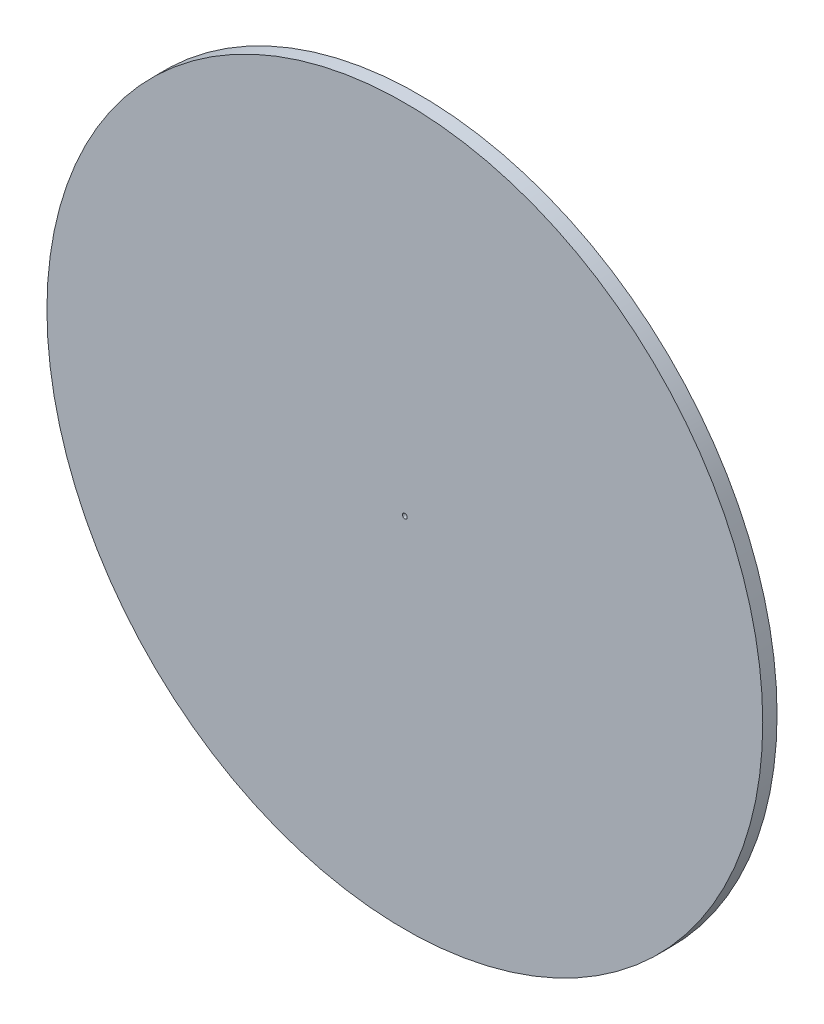
ISO-10303-21;
HEADER;
FILE_DESCRIPTION(('STEP AP214'),'2;1');
FILE_NAME('part.step','',(''),(''),'','','');
FILE_SCHEMA(('AUTOMOTIVE_DESIGN { 1 0 10303 214 1 1 1 1 }'));
ENDSEC;
DATA;
#1=APPLICATION_CONTEXT('core data for automotive mechanical design processes');
#2=APPLICATION_PROTOCOL_DEFINITION('international standard','automotive_design',2000,#1);
#3=PRODUCT_CONTEXT('',#1,'mechanical');
#4=PRODUCT('Part','Part','',(#3));
#5=PRODUCT_RELATED_PRODUCT_CATEGORY('part','',(#4));
#6=PRODUCT_DEFINITION_FORMATION('','',#4);
#7=PRODUCT_DEFINITION_CONTEXT('part definition',#1,'design');
#8=PRODUCT_DEFINITION('design','',#6,#7);
#9=PRODUCT_DEFINITION_SHAPE('','',#8);
#10=(LENGTH_UNIT() NAMED_UNIT(*) SI_UNIT(.MILLI.,.METRE.));
#11=(NAMED_UNIT(*) PLANE_ANGLE_UNIT() SI_UNIT($,.RADIAN.));
#12=(NAMED_UNIT(*) SI_UNIT($,.STERADIAN.) SOLID_ANGLE_UNIT());
#13=UNCERTAINTY_MEASURE_WITH_UNIT(LENGTH_MEASURE(1.E-05),#10,'distance_accuracy_value','');
#14=(GEOMETRIC_REPRESENTATION_CONTEXT(3) GLOBAL_UNCERTAINTY_ASSIGNED_CONTEXT((#13)) GLOBAL_UNIT_ASSIGNED_CONTEXT((#10,
#11,#12)) REPRESENTATION_CONTEXT('',''));
#15=CARTESIAN_POINT('',(0.,0.,0.));
#16=DIRECTION('',(0.,0.,1.));
#17=DIRECTION('',(1.,0.,0.));
#18=AXIS2_PLACEMENT_3D('',#15,#16,#17);
#19=CARTESIAN_POINT('',(0.,0.,3.));
#20=DIRECTION('',(0.,0.,1.));
#21=DIRECTION('',(1.,0.,0.));
#22=AXIS2_PLACEMENT_3D('',#19,#20,#21);
#23=PLANE('',#22);
#24=CARTESIAN_POINT('',(0.,0.,3.));
#25=DIRECTION('',(0.,0.,1.));
#26=DIRECTION('',(1.,0.,0.));
#27=AXIS2_PLACEMENT_3D('',#24,#25,#26);
#28=CIRCLE('',#27,75.);
#29=CARTESIAN_POINT('',(75.,0.,3.));
#30=VERTEX_POINT('',#29);
#31=EDGE_CURVE('E10',#30,#30,#28,.T.);
#32=ORIENTED_EDGE('',*,*,#31,.T.);
#33=EDGE_LOOP('',(#32));
#34=FACE_BOUND('',#33,.T.);
#35=CARTESIAN_POINT('',(0.,0.,3.));
#36=DIRECTION('',(0.,0.,1.));
#37=DIRECTION('',(1.,0.,0.));
#38=AXIS2_PLACEMENT_3D('',#35,#36,#37);
#39=CIRCLE('',#38,0.5);
#40=CARTESIAN_POINT('',(0.5,0.,3.));
#41=VERTEX_POINT('',#40);
#42=EDGE_CURVE('E42',#41,#41,#39,.T.);
#43=ORIENTED_EDGE('',*,*,#42,.F.);
#44=EDGE_LOOP('',(#43));
#45=FACE_BOUND('',#44,.T.);
#46=ADVANCED_FACE('F31',(#34,#45),#23,.T.);
#47=CARTESIAN_POINT('',(0.,0.,0.));
#48=DIRECTION('',(0.,0.,1.));
#49=DIRECTION('',(1.,0.,0.));
#50=AXIS2_PLACEMENT_3D('',#47,#48,#49);
#51=PLANE('',#50);
#52=CARTESIAN_POINT('',(0.,0.,0.));
#53=DIRECTION('',(0.,0.,1.));
#54=DIRECTION('',(1.,0.,0.));
#55=AXIS2_PLACEMENT_3D('',#52,#53,#54);
#56=CIRCLE('',#55,75.);
#57=CARTESIAN_POINT('',(75.,0.,0.));
#58=VERTEX_POINT('',#57);
#59=EDGE_CURVE('E35',#58,#58,#56,.T.);
#60=ORIENTED_EDGE('',*,*,#59,.F.);
#61=EDGE_LOOP('',(#60));
#62=FACE_BOUND('',#61,.T.);
#63=CARTESIAN_POINT('',(0.,0.,0.));
#64=DIRECTION('',(0.,0.,1.));
#65=DIRECTION('',(1.,0.,0.));
#66=AXIS2_PLACEMENT_3D('',#63,#64,#65);
#67=CIRCLE('',#66,0.5);
#68=CARTESIAN_POINT('',(0.5,0.,0.));
#69=VERTEX_POINT('',#68);
#70=EDGE_CURVE('E44',#69,#69,#67,.T.);
#71=ORIENTED_EDGE('',*,*,#70,.T.);
#72=EDGE_LOOP('',(#71));
#73=FACE_BOUND('',#72,.T.);
#74=ADVANCED_FACE('F54',(#62,#73),#51,.F.);
#75=CARTESIAN_POINT('',(0.,0.,3.));
#76=DIRECTION('',(0.,0.,-1.));
#77=DIRECTION('',(-1.,0.,0.));
#78=AXIS2_PLACEMENT_3D('',#75,#76,#77);
#79=CYLINDRICAL_SURFACE('',#78,75.);
#80=ORIENTED_EDGE('',*,*,#31,.F.);
#81=EDGE_LOOP('',(#80));
#82=FACE_BOUND('',#81,.T.);
#83=ORIENTED_EDGE('',*,*,#59,.T.);
#84=EDGE_LOOP('',(#83));
#85=FACE_BOUND('',#84,.T.);
#86=ADVANCED_FACE('F33',(#82,#85),#79,.T.);
#87=CARTESIAN_POINT('',(0.,0.,3.));
#88=DIRECTION('',(0.,0.,-1.));
#89=DIRECTION('',(-1.,0.,0.));
#90=AXIS2_PLACEMENT_3D('',#87,#88,#89);
#91=CYLINDRICAL_SURFACE('',#90,0.5);
#92=ORIENTED_EDGE('',*,*,#42,.T.);
#93=EDGE_LOOP('',(#92));
#94=FACE_BOUND('',#93,.T.);
#95=ORIENTED_EDGE('',*,*,#70,.F.);
#96=EDGE_LOOP('',(#95));
#97=FACE_BOUND('',#96,.T.);
#98=ADVANCED_FACE('F50',(#94,#97),#91,.F.);
#99=CLOSED_SHELL('',(#46,#74,#86,#98));
#100=MANIFOLD_SOLID_BREP('B2',#99);
#101=ADVANCED_BREP_SHAPE_REPRESENTATION('',(#18,#100),#14);
#102=SHAPE_DEFINITION_REPRESENTATION(#9,#101);
ENDSEC;
END-ISO-10303-21;
